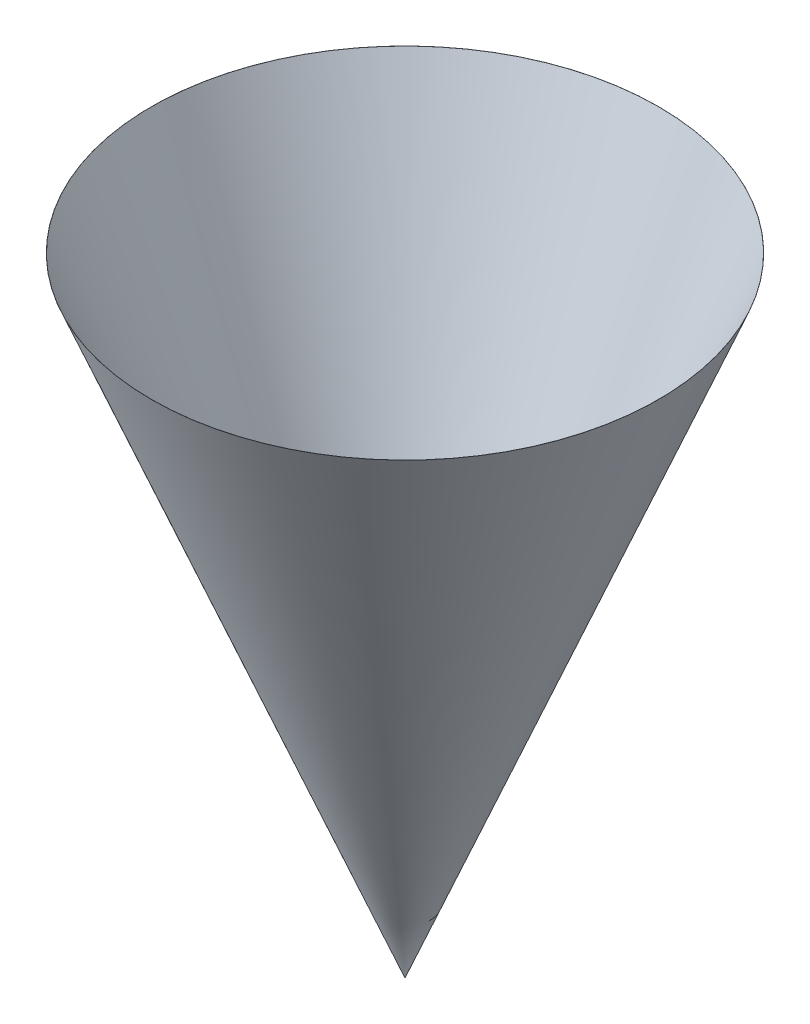
ISO-10303-21;
HEADER;
FILE_DESCRIPTION(('STEP AP214'),'2;1');
FILE_NAME('part.step','',(''),(''),'','','');
FILE_SCHEMA(('AUTOMOTIVE_DESIGN { 1 0 10303 214 1 1 1 1 }'));
ENDSEC;
DATA;
#1=APPLICATION_CONTEXT('core data for automotive mechanical design processes');
#2=APPLICATION_PROTOCOL_DEFINITION('international standard','automotive_design',2000,#1);
#3=PRODUCT_CONTEXT('',#1,'mechanical');
#4=PRODUCT('Part','Part','',(#3));
#5=PRODUCT_RELATED_PRODUCT_CATEGORY('part','',(#4));
#6=PRODUCT_DEFINITION_FORMATION('','',#4);
#7=PRODUCT_DEFINITION_CONTEXT('part definition',#1,'design');
#8=PRODUCT_DEFINITION('design','',#6,#7);
#9=PRODUCT_DEFINITION_SHAPE('','',#8);
#10=(LENGTH_UNIT() NAMED_UNIT(*) SI_UNIT(.MILLI.,.METRE.));
#11=(NAMED_UNIT(*) PLANE_ANGLE_UNIT() SI_UNIT($,.RADIAN.));
#12=(NAMED_UNIT(*) SI_UNIT($,.STERADIAN.) SOLID_ANGLE_UNIT());
#13=UNCERTAINTY_MEASURE_WITH_UNIT(LENGTH_MEASURE(1.E-05),#10,'distance_accuracy_value','');
#14=(GEOMETRIC_REPRESENTATION_CONTEXT(3) GLOBAL_UNCERTAINTY_ASSIGNED_CONTEXT((#13)) GLOBAL_UNIT_ASSIGNED_CONTEXT((#10,
#11,#12)) REPRESENTATION_CONTEXT('',''));
#15=CARTESIAN_POINT('',(0.,0.,0.));
#16=DIRECTION('',(0.,0.,1.));
#17=DIRECTION('',(1.,0.,0.));
#18=AXIS2_PLACEMENT_3D('',#15,#16,#17);
#19=CARTESIAN_POINT('',(0.,80.,0.));
#20=DIRECTION('',(0.,1.,0.));
#21=DIRECTION('',(0.,0.,1.));
#22=AXIS2_PLACEMENT_3D('',#19,#20,#21);
#23=CONICAL_SURFACE('',#22,32.312098066812,0.383972435438746);
#24=CARTESIAN_POINT('',(0.,0.024750868534186,0.));
#25=VERTEX_POINT('',#24);
#26=VERTEX_LOOP('',#25);
#27=FACE_BOUND('',#26,.T.);
#28=CARTESIAN_POINT('',(0.,80.,0.));
#29=DIRECTION('',(0.,-1.,0.));
#30=DIRECTION('',(0.,0.,-1.));
#31=AXIS2_PLACEMENT_3D('',#28,#29,#30);
#32=CIRCLE('',#31,32.312098066812);
#33=CARTESIAN_POINT('',(0.,80.,-32.312098066812));
#34=VERTEX_POINT('',#33);
#35=EDGE_CURVE('E11',#34,#34,#32,.T.);
#36=ORIENTED_EDGE('',*,*,#35,.F.);
#37=EDGE_LOOP('',(#36));
#38=FACE_BOUND('',#37,.T.);
#39=ADVANCED_FACE('F35',(#27,#38),#23,.F.);
#40=CARTESIAN_POINT('',(0.,80.,-32.322098066812));
#41=DIRECTION('',(0.,1.,0.));
#42=DIRECTION('',(0.,0.,1.));
#43=AXIS2_PLACEMENT_3D('',#40,#41,#42);
#44=PLANE('',#43);
#45=ORIENTED_EDGE('',*,*,#35,.T.);
#46=EDGE_LOOP('',(#45));
#47=FACE_BOUND('',#46,.T.);
#48=CARTESIAN_POINT('',(0.,80.,0.));
#49=DIRECTION('',(0.,-1.,0.));
#50=DIRECTION('',(0.,0.,-1.));
#51=AXIS2_PLACEMENT_3D('',#48,#49,#50);
#52=CIRCLE('',#51,32.322098066812);
#53=CARTESIAN_POINT('',(0.,80.,-32.322098066812));
#54=VERTEX_POINT('',#53);
#55=EDGE_CURVE('E42',#54,#54,#52,.T.);
#56=ORIENTED_EDGE('',*,*,#55,.F.);
#57=EDGE_LOOP('',(#56));
#58=FACE_BOUND('',#57,.T.);
#59=ADVANCED_FACE('F50',(#47,#58),#44,.T.);
#60=CARTESIAN_POINT('',(0.,0.,0.));
#61=DIRECTION('',(0.,1.,0.));
#62=DIRECTION('',(0.,0.,1.));
#63=AXIS2_PLACEMENT_3D('',#60,#61,#62);
#64=CONICAL_SURFACE('',#63,0.,0.383972435438746);
#65=ORIENTED_EDGE('',*,*,#55,.T.);
#66=EDGE_LOOP('',(#65));
#67=FACE_BOUND('',#66,.T.);
#68=CARTESIAN_POINT('',(0.,0.,0.));
#69=VERTEX_POINT('',#68);
#70=VERTEX_LOOP('',#69);
#71=FACE_BOUND('',#70,.T.);
#72=ADVANCED_FACE('F48',(#67,#71),#64,.T.);
#73=CLOSED_SHELL('',(#39,#59,#72));
#74=MANIFOLD_SOLID_BREP('B2',#73);
#75=ADVANCED_BREP_SHAPE_REPRESENTATION('',(#18,#74),#14);
#76=SHAPE_DEFINITION_REPRESENTATION(#9,#75);
ENDSEC;
END-ISO-10303-21;
